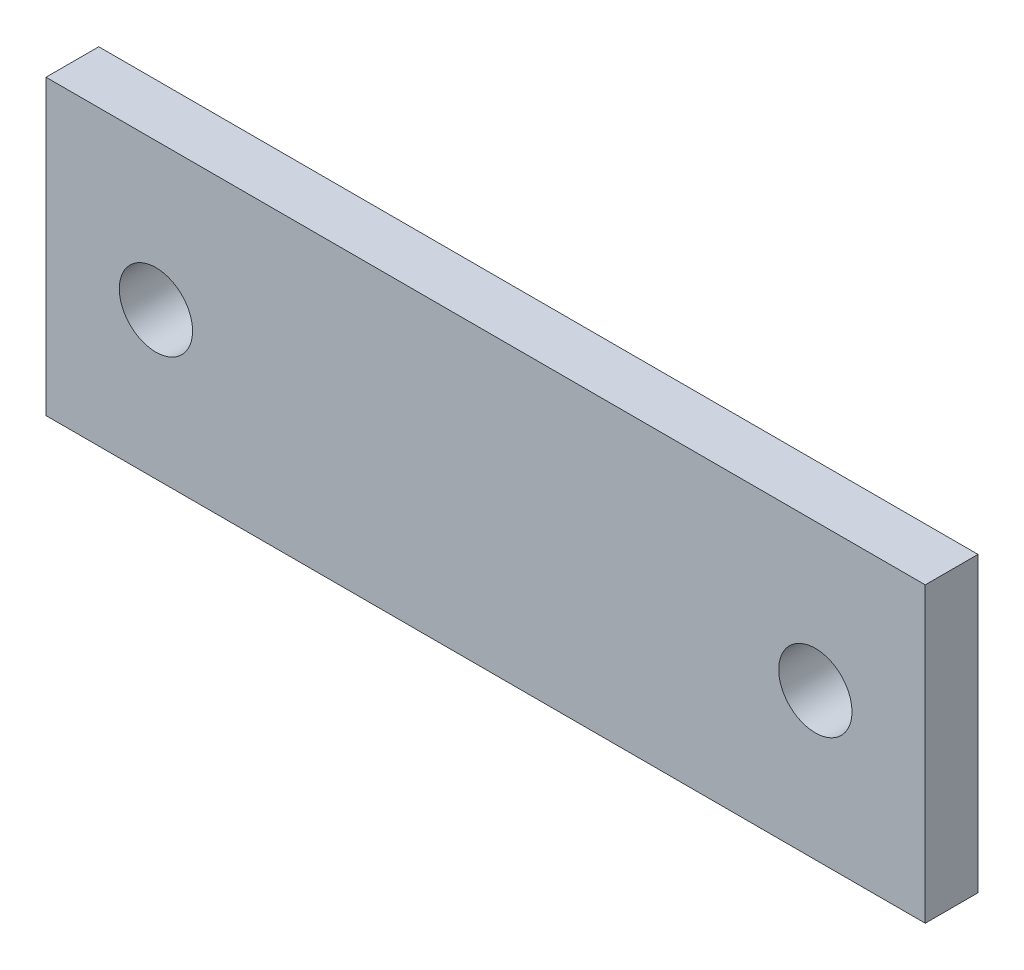
ISO-10303-21;
HEADER;
FILE_DESCRIPTION(('STEP AP214'),'2;1');
FILE_NAME('part.step','',(''),(''),'','','');
FILE_SCHEMA(('AUTOMOTIVE_DESIGN { 1 0 10303 214 1 1 1 1 }'));
ENDSEC;
DATA;
#1=APPLICATION_CONTEXT('core data for automotive mechanical design processes');
#2=APPLICATION_PROTOCOL_DEFINITION('international standard','automotive_design',2000,#1);
#3=PRODUCT_CONTEXT('',#1,'mechanical');
#4=PRODUCT('Part','Part','',(#3));
#5=PRODUCT_RELATED_PRODUCT_CATEGORY('part','',(#4));
#6=PRODUCT_DEFINITION_FORMATION('','',#4);
#7=PRODUCT_DEFINITION_CONTEXT('part definition',#1,'design');
#8=PRODUCT_DEFINITION('design','',#6,#7);
#9=PRODUCT_DEFINITION_SHAPE('','',#8);
#10=(LENGTH_UNIT() NAMED_UNIT(*) SI_UNIT(.MILLI.,.METRE.));
#11=(NAMED_UNIT(*) PLANE_ANGLE_UNIT() SI_UNIT($,.RADIAN.));
#12=(NAMED_UNIT(*) SI_UNIT($,.STERADIAN.) SOLID_ANGLE_UNIT());
#13=UNCERTAINTY_MEASURE_WITH_UNIT(LENGTH_MEASURE(1.E-05),#10,'distance_accuracy_value','');
#14=(GEOMETRIC_REPRESENTATION_CONTEXT(3) GLOBAL_UNCERTAINTY_ASSIGNED_CONTEXT((#13)) GLOBAL_UNIT_ASSIGNED_CONTEXT((#10,
#11,#12)) REPRESENTATION_CONTEXT('',''));
#15=CARTESIAN_POINT('',(0.,0.,0.));
#16=DIRECTION('',(0.,0.,1.));
#17=DIRECTION('',(1.,0.,0.));
#18=AXIS2_PLACEMENT_3D('',#15,#16,#17);
#19=CARTESIAN_POINT('',(-38.1,12.7,-4.572));
#20=DIRECTION('',(-1.,0.,0.));
#21=DIRECTION('',(0.,-1.,0.));
#22=AXIS2_PLACEMENT_3D('',#19,#20,#21);
#23=PLANE('',#22);
#24=DIRECTION('',(0.,-1.,0.));
#25=VECTOR('',#24,1.);
#26=CARTESIAN_POINT('',(-38.1,12.7,0.));
#27=LINE('',#26,#25);
#28=CARTESIAN_POINT('',(-38.1,12.7,0.));
#29=VERTEX_POINT('',#28);
#30=CARTESIAN_POINT('',(-38.1,-12.7,0.));
#31=VERTEX_POINT('',#30);
#32=EDGE_CURVE('E97',#29,#31,#27,.T.);
#33=ORIENTED_EDGE('',*,*,#32,.F.);
#34=DIRECTION('',(0.,0.,1.));
#35=VECTOR('',#34,1.);
#36=CARTESIAN_POINT('',(-38.1,12.7,-4.572));
#37=LINE('',#36,#35);
#38=CARTESIAN_POINT('',(-38.1,12.7,-4.572));
#39=VERTEX_POINT('',#38);
#40=EDGE_CURVE('E11',#39,#29,#37,.T.);
#41=ORIENTED_EDGE('',*,*,#40,.F.);
#42=DIRECTION('',(0.,-1.,0.));
#43=VECTOR('',#42,1.);
#44=CARTESIAN_POINT('',(-38.1,12.7,-4.572));
#45=LINE('',#44,#43);
#46=CARTESIAN_POINT('',(-38.1,-12.7,-4.572));
#47=VERTEX_POINT('',#46);
#48=EDGE_CURVE('E90',#39,#47,#45,.T.);
#49=ORIENTED_EDGE('',*,*,#48,.T.);
#50=DIRECTION('',(0.,0.,1.));
#51=VECTOR('',#50,1.);
#52=CARTESIAN_POINT('',(-38.1,-12.7,-4.572));
#53=LINE('',#52,#51);
#54=EDGE_CURVE('E35',#47,#31,#53,.T.);
#55=ORIENTED_EDGE('',*,*,#54,.T.);
#56=EDGE_LOOP('',(#33,#41,#49,#55));
#57=FACE_BOUND('',#56,.T.);
#58=ADVANCED_FACE('F32',(#57),#23,.T.);
#59=CARTESIAN_POINT('',(-38.1,12.7,-4.572));
#60=DIRECTION('',(0.,1.,0.));
#61=DIRECTION('',(0.,0.,1.));
#62=AXIS2_PLACEMENT_3D('',#59,#60,#61);
#63=PLANE('',#62);
#64=DIRECTION('',(-1.,0.,0.));
#65=VECTOR('',#64,1.);
#66=CARTESIAN_POINT('',(-38.1,12.7,0.));
#67=LINE('',#66,#65);
#68=CARTESIAN_POINT('',(38.1,12.7,0.));
#69=VERTEX_POINT('',#68);
#70=EDGE_CURVE('E92',#69,#29,#67,.T.);
#71=ORIENTED_EDGE('',*,*,#70,.F.);
#72=DIRECTION('',(0.,0.,1.));
#73=VECTOR('',#72,1.);
#74=CARTESIAN_POINT('',(38.1,12.7,-4.572));
#75=LINE('',#74,#73);
#76=CARTESIAN_POINT('',(38.1,12.7,-4.572));
#77=VERTEX_POINT('',#76);
#78=EDGE_CURVE('E41',#77,#69,#75,.T.);
#79=ORIENTED_EDGE('',*,*,#78,.F.);
#80=DIRECTION('',(-1.,0.,0.));
#81=VECTOR('',#80,1.);
#82=CARTESIAN_POINT('',(-38.1,12.7,-4.572));
#83=LINE('',#82,#81);
#84=EDGE_CURVE('E87',#77,#39,#83,.T.);
#85=ORIENTED_EDGE('',*,*,#84,.T.);
#86=ORIENTED_EDGE('',*,*,#40,.T.);
#87=EDGE_LOOP('',(#71,#79,#85,#86));
#88=FACE_BOUND('',#87,.T.);
#89=ADVANCED_FACE('F108',(#88),#63,.T.);
#90=CARTESIAN_POINT('',(38.1,12.7,-4.572));
#91=DIRECTION('',(1.,0.,0.));
#92=DIRECTION('',(0.,0.,-1.));
#93=AXIS2_PLACEMENT_3D('',#90,#91,#92);
#94=PLANE('',#93);
#95=DIRECTION('',(0.,1.,0.));
#96=VECTOR('',#95,1.);
#97=CARTESIAN_POINT('',(38.1,12.7,0.));
#98=LINE('',#97,#96);
#99=CARTESIAN_POINT('',(38.1,-12.7,0.));
#100=VERTEX_POINT('',#99);
#101=EDGE_CURVE('E82',#100,#69,#98,.T.);
#102=ORIENTED_EDGE('',*,*,#101,.F.);
#103=DIRECTION('',(0.,0.,1.));
#104=VECTOR('',#103,1.);
#105=CARTESIAN_POINT('',(38.1,-12.7,-4.572));
#106=LINE('',#105,#104);
#107=CARTESIAN_POINT('',(38.1,-12.7,-4.572));
#108=VERTEX_POINT('',#107);
#109=EDGE_CURVE('E77',#108,#100,#106,.T.);
#110=ORIENTED_EDGE('',*,*,#109,.F.);
#111=DIRECTION('',(0.,1.,0.));
#112=VECTOR('',#111,1.);
#113=CARTESIAN_POINT('',(38.1,12.7,-4.572));
#114=LINE('',#113,#112);
#115=EDGE_CURVE('E80',#108,#77,#114,.T.);
#116=ORIENTED_EDGE('',*,*,#115,.T.);
#117=ORIENTED_EDGE('',*,*,#78,.T.);
#118=EDGE_LOOP('',(#102,#110,#116,#117));
#119=FACE_BOUND('',#118,.T.);
#120=ADVANCED_FACE('F79',(#119),#94,.T.);
#121=CARTESIAN_POINT('',(-38.1,-12.7,-4.572));
#122=DIRECTION('',(0.,-1.,0.));
#123=DIRECTION('',(1.,0.,0.));
#124=AXIS2_PLACEMENT_3D('',#121,#122,#123);
#125=PLANE('',#124);
#126=DIRECTION('',(1.,0.,0.));
#127=VECTOR('',#126,1.);
#128=CARTESIAN_POINT('',(-38.1,-12.7,0.));
#129=LINE('',#128,#127);
#130=EDGE_CURVE('E100',#31,#100,#129,.T.);
#131=ORIENTED_EDGE('',*,*,#130,.F.);
#132=ORIENTED_EDGE('',*,*,#54,.F.);
#133=DIRECTION('',(1.,0.,0.));
#134=VECTOR('',#133,1.);
#135=CARTESIAN_POINT('',(-38.1,-12.7,-4.572));
#136=LINE('',#135,#134);
#137=EDGE_CURVE('E86',#47,#108,#136,.T.);
#138=ORIENTED_EDGE('',*,*,#137,.T.);
#139=ORIENTED_EDGE('',*,*,#109,.T.);
#140=EDGE_LOOP('',(#131,#132,#138,#139));
#141=FACE_BOUND('',#140,.T.);
#142=ADVANCED_FACE('F89',(#141),#125,.T.);
#143=CARTESIAN_POINT('',(-38.1,-12.7,-4.572));
#144=DIRECTION('',(0.,0.,1.));
#145=DIRECTION('',(1.,0.,0.));
#146=AXIS2_PLACEMENT_3D('',#143,#144,#145);
#147=PLANE('',#146);
#148=CARTESIAN_POINT('',(28.575,0.,-4.572));
#149=DIRECTION('',(0.,0.,1.));
#150=DIRECTION('',(1.,0.,0.));
#151=AXIS2_PLACEMENT_3D('',#148,#149,#150);
#152=CIRCLE('',#151,3.175);
#153=CARTESIAN_POINT('',(31.75,0.,-4.572));
#154=VERTEX_POINT('',#153);
#155=EDGE_CURVE('E141',#154,#154,#152,.T.);
#156=ORIENTED_EDGE('',*,*,#155,.T.);
#157=EDGE_LOOP('',(#156));
#158=FACE_BOUND('',#157,.T.);
#159=CARTESIAN_POINT('',(-28.575,0.,-4.572));
#160=DIRECTION('',(0.,0.,1.));
#161=DIRECTION('',(1.,0.,0.));
#162=AXIS2_PLACEMENT_3D('',#159,#160,#161);
#163=CIRCLE('',#162,3.175);
#164=CARTESIAN_POINT('',(-25.4,0.,-4.572));
#165=VERTEX_POINT('',#164);
#166=EDGE_CURVE('E101',#165,#165,#163,.T.);
#167=ORIENTED_EDGE('',*,*,#166,.T.);
#168=EDGE_LOOP('',(#167));
#169=FACE_BOUND('',#168,.T.);
#170=ORIENTED_EDGE('',*,*,#48,.F.);
#171=ORIENTED_EDGE('',*,*,#84,.F.);
#172=ORIENTED_EDGE('',*,*,#115,.F.);
#173=ORIENTED_EDGE('',*,*,#137,.F.);
#174=EDGE_LOOP('',(#170,#171,#172,#173));
#175=FACE_BOUND('',#174,.T.);
#176=ADVANCED_FACE('F85',(#158,#169,#175),#147,.F.);
#177=CARTESIAN_POINT('',(-38.1,-12.7,0.));
#178=DIRECTION('',(0.,0.,1.));
#179=DIRECTION('',(1.,0.,0.));
#180=AXIS2_PLACEMENT_3D('',#177,#178,#179);
#181=PLANE('',#180);
#182=CARTESIAN_POINT('',(28.575,0.,0.));
#183=DIRECTION('',(0.,0.,1.));
#184=DIRECTION('',(1.,0.,0.));
#185=AXIS2_PLACEMENT_3D('',#182,#183,#184);
#186=CIRCLE('',#185,3.175);
#187=CARTESIAN_POINT('',(31.75,0.,0.));
#188=VERTEX_POINT('',#187);
#189=EDGE_CURVE('E144',#188,#188,#186,.T.);
#190=ORIENTED_EDGE('',*,*,#189,.F.);
#191=EDGE_LOOP('',(#190));
#192=FACE_BOUND('',#191,.T.);
#193=CARTESIAN_POINT('',(-28.575,0.,0.));
#194=DIRECTION('',(0.,0.,1.));
#195=DIRECTION('',(1.,0.,0.));
#196=AXIS2_PLACEMENT_3D('',#193,#194,#195);
#197=CIRCLE('',#196,3.175);
#198=CARTESIAN_POINT('',(-25.4,0.,0.));
#199=VERTEX_POINT('',#198);
#200=EDGE_CURVE('E146',#199,#199,#197,.T.);
#201=ORIENTED_EDGE('',*,*,#200,.F.);
#202=EDGE_LOOP('',(#201));
#203=FACE_BOUND('',#202,.T.);
#204=ORIENTED_EDGE('',*,*,#32,.T.);
#205=ORIENTED_EDGE('',*,*,#130,.T.);
#206=ORIENTED_EDGE('',*,*,#101,.T.);
#207=ORIENTED_EDGE('',*,*,#70,.T.);
#208=EDGE_LOOP('',(#204,#205,#206,#207));
#209=FACE_BOUND('',#208,.T.);
#210=ADVANCED_FACE('F107',(#192,#203,#209),#181,.T.);
#211=CARTESIAN_POINT('',(-28.575,0.,-4.572));
#212=DIRECTION('',(0.,0.,1.));
#213=DIRECTION('',(1.,0.,0.));
#214=AXIS2_PLACEMENT_3D('',#211,#212,#213);
#215=CYLINDRICAL_SURFACE('',#214,3.175);
#216=ORIENTED_EDGE('',*,*,#166,.F.);
#217=EDGE_LOOP('',(#216));
#218=FACE_BOUND('',#217,.T.);
#219=ORIENTED_EDGE('',*,*,#200,.T.);
#220=EDGE_LOOP('',(#219));
#221=FACE_BOUND('',#220,.T.);
#222=ADVANCED_FACE('F126',(#218,#221),#215,.F.);
#223=CARTESIAN_POINT('',(28.575,0.,-4.572));
#224=DIRECTION('',(0.,0.,1.));
#225=DIRECTION('',(1.,0.,0.));
#226=AXIS2_PLACEMENT_3D('',#223,#224,#225);
#227=CYLINDRICAL_SURFACE('',#226,3.175);
#228=ORIENTED_EDGE('',*,*,#155,.F.);
#229=EDGE_LOOP('',(#228));
#230=FACE_BOUND('',#229,.T.);
#231=ORIENTED_EDGE('',*,*,#189,.T.);
#232=EDGE_LOOP('',(#231));
#233=FACE_BOUND('',#232,.T.);
#234=ADVANCED_FACE('F133',(#230,#233),#227,.F.);
#235=CLOSED_SHELL('',(#58,#89,#120,#142,#176,#210,#222,#234));
#236=MANIFOLD_SOLID_BREP('B2',#235);
#237=ADVANCED_BREP_SHAPE_REPRESENTATION('',(#18,#236),#14);
#238=SHAPE_DEFINITION_REPRESENTATION(#9,#237);
ENDSEC;
END-ISO-10303-21;
